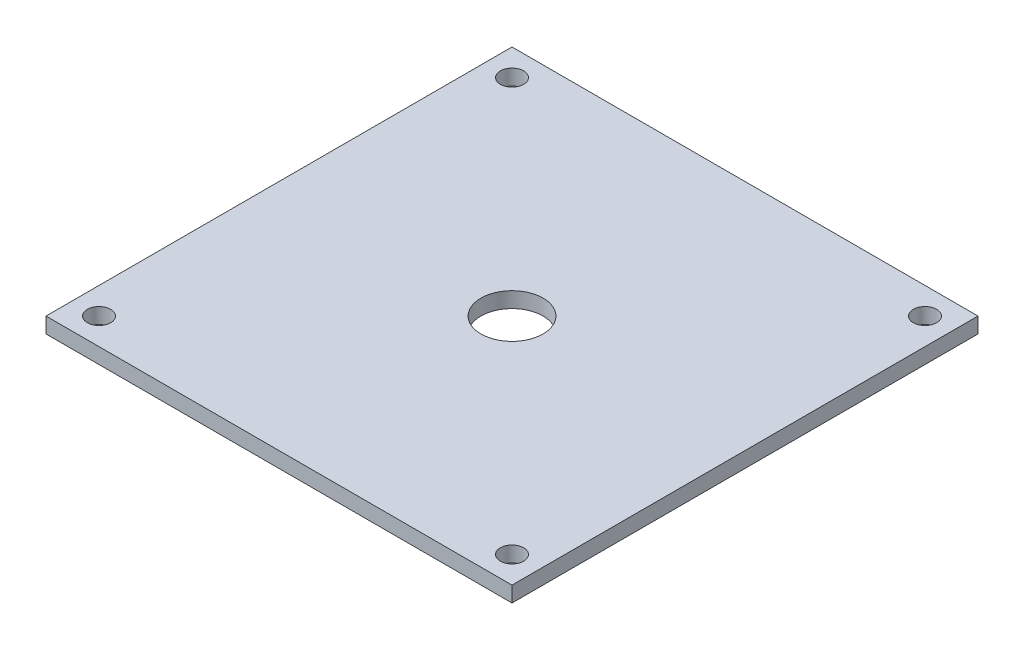
ISO-10303-21;
HEADER;
FILE_DESCRIPTION(('STEP AP214'),'2;1');
FILE_NAME('part.step','',(''),(''),'','','');
FILE_SCHEMA(('AUTOMOTIVE_DESIGN { 1 0 10303 214 1 1 1 1 }'));
ENDSEC;
DATA;
#1=APPLICATION_CONTEXT('core data for automotive mechanical design processes');
#2=APPLICATION_PROTOCOL_DEFINITION('international standard','automotive_design',2000,#1);
#3=PRODUCT_CONTEXT('',#1,'mechanical');
#4=PRODUCT('Part','Part','',(#3));
#5=PRODUCT_RELATED_PRODUCT_CATEGORY('part','',(#4));
#6=PRODUCT_DEFINITION_FORMATION('','',#4);
#7=PRODUCT_DEFINITION_CONTEXT('part definition',#1,'design');
#8=PRODUCT_DEFINITION('design','',#6,#7);
#9=PRODUCT_DEFINITION_SHAPE('','',#8);
#10=(LENGTH_UNIT() NAMED_UNIT(*) SI_UNIT(.MILLI.,.METRE.));
#11=(NAMED_UNIT(*) PLANE_ANGLE_UNIT() SI_UNIT($,.RADIAN.));
#12=(NAMED_UNIT(*) SI_UNIT($,.STERADIAN.) SOLID_ANGLE_UNIT());
#13=UNCERTAINTY_MEASURE_WITH_UNIT(LENGTH_MEASURE(1.E-05),#10,'distance_accuracy_value','');
#14=(GEOMETRIC_REPRESENTATION_CONTEXT(3) GLOBAL_UNCERTAINTY_ASSIGNED_CONTEXT((#13)) GLOBAL_UNIT_ASSIGNED_CONTEXT((#10,
#11,#12)) REPRESENTATION_CONTEXT('',''));
#15=CARTESIAN_POINT('',(0.,0.,0.));
#16=DIRECTION('',(0.,0.,1.));
#17=DIRECTION('',(1.,0.,0.));
#18=AXIS2_PLACEMENT_3D('',#15,#16,#17);
#19=CARTESIAN_POINT('',(0.,10.,0.));
#20=DIRECTION('',(0.,-1.,0.));
#21=DIRECTION('',(0.,0.,-1.));
#22=AXIS2_PLACEMENT_3D('',#19,#20,#21);
#23=PLANE('',#22);
#24=DIRECTION('',(0.,0.,-1.));
#25=VECTOR('',#24,1.);
#26=CARTESIAN_POINT('',(150.,10.,150.));
#27=LINE('',#26,#25);
#28=CARTESIAN_POINT('',(150.,10.,150.));
#29=VERTEX_POINT('',#28);
#30=CARTESIAN_POINT('',(150.,10.,-150.));
#31=VERTEX_POINT('',#30);
#32=EDGE_CURVE('E88',#29,#31,#27,.T.);
#33=ORIENTED_EDGE('',*,*,#32,.T.);
#34=DIRECTION('',(-1.,0.,0.));
#35=VECTOR('',#34,1.);
#36=CARTESIAN_POINT('',(-150.,10.,-150.));
#37=LINE('',#36,#35);
#38=CARTESIAN_POINT('',(-150.,10.,-150.));
#39=VERTEX_POINT('',#38);
#40=EDGE_CURVE('E83',#31,#39,#37,.T.);
#41=ORIENTED_EDGE('',*,*,#40,.T.);
#42=DIRECTION('',(0.,0.,1.));
#43=VECTOR('',#42,1.);
#44=CARTESIAN_POINT('',(-150.,10.,150.));
#45=LINE('',#44,#43);
#46=CARTESIAN_POINT('',(-150.,10.,150.));
#47=VERTEX_POINT('',#46);
#48=EDGE_CURVE('E86',#39,#47,#45,.T.);
#49=ORIENTED_EDGE('',*,*,#48,.T.);
#50=DIRECTION('',(1.,0.,0.));
#51=VECTOR('',#50,1.);
#52=CARTESIAN_POINT('',(-150.,10.,150.));
#53=LINE('',#52,#51);
#54=EDGE_CURVE('E53',#47,#29,#53,.T.);
#55=ORIENTED_EDGE('',*,*,#54,.T.);
#56=EDGE_LOOP('',(#33,#41,#49,#55));
#57=FACE_BOUND('',#56,.T.);
#58=CARTESIAN_POINT('',(0.,10.,0.));
#59=DIRECTION('',(0.,1.,0.));
#60=DIRECTION('',(0.,0.,1.));
#61=AXIS2_PLACEMENT_3D('',#58,#59,#60);
#62=CIRCLE('',#61,20.);
#63=CARTESIAN_POINT('',(0.,10.,20.));
#64=VERTEX_POINT('',#63);
#65=EDGE_CURVE('E103',#64,#64,#62,.T.);
#66=ORIENTED_EDGE('',*,*,#65,.F.);
#67=EDGE_LOOP('',(#66));
#68=FACE_BOUND('',#67,.T.);
#69=CARTESIAN_POINT('',(-132.936074863071,10.,-132.936074863071));
#70=DIRECTION('',(0.,1.,0.));
#71=DIRECTION('',(0.,0.,1.));
#72=AXIS2_PLACEMENT_3D('',#69,#70,#71);
#73=CIRCLE('',#72,7.50000000000001);
#74=CARTESIAN_POINT('',(-132.936074863071,10.,-125.436074863071));
#75=VERTEX_POINT('',#74);
#76=EDGE_CURVE('E118',#75,#75,#73,.T.);
#77=ORIENTED_EDGE('',*,*,#76,.F.);
#78=EDGE_LOOP('',(#77));
#79=FACE_BOUND('',#78,.T.);
#80=CARTESIAN_POINT('',(132.936074863071,10.,-132.936074863094));
#81=DIRECTION('',(0.,1.,0.));
#82=DIRECTION('',(0.,0.,1.));
#83=AXIS2_PLACEMENT_3D('',#80,#81,#82);
#84=CIRCLE('',#83,7.50000000002221);
#85=CARTESIAN_POINT('',(132.936074863071,10.,-125.436074863071));
#86=VERTEX_POINT('',#85);
#87=EDGE_CURVE('E124',#86,#86,#84,.T.);
#88=ORIENTED_EDGE('',*,*,#87,.F.);
#89=EDGE_LOOP('',(#88));
#90=FACE_BOUND('',#89,.T.);
#91=CARTESIAN_POINT('',(132.936074863094,10.,132.936074863048));
#92=DIRECTION('',(0.,1.,0.));
#93=DIRECTION('',(0.,0.,1.));
#94=AXIS2_PLACEMENT_3D('',#91,#92,#93);
#95=CIRCLE('',#94,7.50000000002935);
#96=CARTESIAN_POINT('',(132.936074863094,10.,140.436074863078));
#97=VERTEX_POINT('',#96);
#98=EDGE_CURVE('E130',#97,#97,#95,.T.);
#99=ORIENTED_EDGE('',*,*,#98,.F.);
#100=EDGE_LOOP('',(#99));
#101=FACE_BOUND('',#100,.T.);
#102=CARTESIAN_POINT('',(-132.936074863048,10.,132.936074863071));
#103=DIRECTION('',(0.,1.,0.));
#104=DIRECTION('',(0.,0.,1.));
#105=AXIS2_PLACEMENT_3D('',#102,#103,#104);
#106=CIRCLE('',#105,7.50000000000839);
#107=CARTESIAN_POINT('',(-132.936074863048,10.,140.436074863079));
#108=VERTEX_POINT('',#107);
#109=EDGE_CURVE('E136',#108,#108,#106,.T.);
#110=ORIENTED_EDGE('',*,*,#109,.F.);
#111=EDGE_LOOP('',(#110));
#112=FACE_BOUND('',#111,.T.);
#113=ADVANCED_FACE('F36',(#57,#68,#79,#90,#101,#112),#23,.F.);
#114=CARTESIAN_POINT('',(0.,0.,0.));
#115=DIRECTION('',(0.,-1.,0.));
#116=DIRECTION('',(0.,0.,-1.));
#117=AXIS2_PLACEMENT_3D('',#114,#115,#116);
#118=PLANE('',#117);
#119=CARTESIAN_POINT('',(132.936074863094,0.,132.936074863048));
#120=DIRECTION('',(0.,1.,0.));
#121=DIRECTION('',(0.,0.,1.));
#122=AXIS2_PLACEMENT_3D('',#119,#120,#121);
#123=CIRCLE('',#122,7.50000000002935);
#124=CARTESIAN_POINT('',(132.936074863094,0.,140.436074863078));
#125=VERTEX_POINT('',#124);
#126=EDGE_CURVE('E133',#125,#125,#123,.T.);
#127=ORIENTED_EDGE('',*,*,#126,.T.);
#128=EDGE_LOOP('',(#127));
#129=FACE_BOUND('',#128,.T.);
#130=CARTESIAN_POINT('',(-132.936074863071,0.,-132.936074863071));
#131=DIRECTION('',(0.,1.,0.));
#132=DIRECTION('',(0.,0.,1.));
#133=AXIS2_PLACEMENT_3D('',#130,#131,#132);
#134=CIRCLE('',#133,7.50000000000001);
#135=CARTESIAN_POINT('',(-132.936074863071,0.,-125.436074863071));
#136=VERTEX_POINT('',#135);
#137=EDGE_CURVE('E121',#136,#136,#134,.T.);
#138=ORIENTED_EDGE('',*,*,#137,.T.);
#139=EDGE_LOOP('',(#138));
#140=FACE_BOUND('',#139,.T.);
#141=DIRECTION('',(0.,0.,-1.));
#142=VECTOR('',#141,1.);
#143=CARTESIAN_POINT('',(150.,0.,150.));
#144=LINE('',#143,#142);
#145=CARTESIAN_POINT('',(150.,0.,150.));
#146=VERTEX_POINT('',#145);
#147=CARTESIAN_POINT('',(150.,0.,-150.));
#148=VERTEX_POINT('',#147);
#149=EDGE_CURVE('E100',#146,#148,#144,.T.);
#150=ORIENTED_EDGE('',*,*,#149,.F.);
#151=DIRECTION('',(1.,0.,0.));
#152=VECTOR('',#151,1.);
#153=CARTESIAN_POINT('',(-150.,0.,150.));
#154=LINE('',#153,#152);
#155=CARTESIAN_POINT('',(-150.,0.,150.));
#156=VERTEX_POINT('',#155);
#157=EDGE_CURVE('E76',#156,#146,#154,.T.);
#158=ORIENTED_EDGE('',*,*,#157,.F.);
#159=DIRECTION('',(0.,0.,1.));
#160=VECTOR('',#159,1.);
#161=CARTESIAN_POINT('',(-150.,0.,150.));
#162=LINE('',#161,#160);
#163=CARTESIAN_POINT('',(-150.,0.,-150.));
#164=VERTEX_POINT('',#163);
#165=EDGE_CURVE('E70',#164,#156,#162,.T.);
#166=ORIENTED_EDGE('',*,*,#165,.F.);
#167=DIRECTION('',(-1.,0.,0.));
#168=VECTOR('',#167,1.);
#169=CARTESIAN_POINT('',(-150.,0.,-150.));
#170=LINE('',#169,#168);
#171=EDGE_CURVE('E92',#148,#164,#170,.T.);
#172=ORIENTED_EDGE('',*,*,#171,.F.);
#173=EDGE_LOOP('',(#150,#158,#166,#172));
#174=FACE_BOUND('',#173,.T.);
#175=CARTESIAN_POINT('',(0.,0.,0.));
#176=DIRECTION('',(0.,1.,0.));
#177=DIRECTION('',(0.,0.,1.));
#178=AXIS2_PLACEMENT_3D('',#175,#176,#177);
#179=CIRCLE('',#178,20.);
#180=CARTESIAN_POINT('',(0.,0.,20.));
#181=VERTEX_POINT('',#180);
#182=EDGE_CURVE('E115',#181,#181,#179,.T.);
#183=ORIENTED_EDGE('',*,*,#182,.T.);
#184=EDGE_LOOP('',(#183));
#185=FACE_BOUND('',#184,.T.);
#186=CARTESIAN_POINT('',(132.936074863071,0.,-132.936074863094));
#187=DIRECTION('',(0.,1.,0.));
#188=DIRECTION('',(0.,0.,1.));
#189=AXIS2_PLACEMENT_3D('',#186,#187,#188);
#190=CIRCLE('',#189,7.50000000002221);
#191=CARTESIAN_POINT('',(132.936074863071,0.,-125.436074863071));
#192=VERTEX_POINT('',#191);
#193=EDGE_CURVE('E127',#192,#192,#190,.T.);
#194=ORIENTED_EDGE('',*,*,#193,.T.);
#195=EDGE_LOOP('',(#194));
#196=FACE_BOUND('',#195,.T.);
#197=CARTESIAN_POINT('',(-132.936074863048,0.,132.936074863071));
#198=DIRECTION('',(0.,1.,0.));
#199=DIRECTION('',(0.,0.,1.));
#200=AXIS2_PLACEMENT_3D('',#197,#198,#199);
#201=CIRCLE('',#200,7.50000000000839);
#202=CARTESIAN_POINT('',(-132.936074863048,0.,140.436074863079));
#203=VERTEX_POINT('',#202);
#204=EDGE_CURVE('E139',#203,#203,#201,.T.);
#205=ORIENTED_EDGE('',*,*,#204,.T.);
#206=EDGE_LOOP('',(#205));
#207=FACE_BOUND('',#206,.T.);
#208=ADVANCED_FACE('F111',(#129,#140,#174,#185,#196,#207),#118,.T.);
#209=CARTESIAN_POINT('',(150.,10.,150.));
#210=DIRECTION('',(-1.,0.,0.));
#211=DIRECTION('',(0.,0.,1.));
#212=AXIS2_PLACEMENT_3D('',#209,#210,#211);
#213=PLANE('',#212);
#214=ORIENTED_EDGE('',*,*,#149,.T.);
#215=DIRECTION('',(0.,-1.,0.));
#216=VECTOR('',#215,1.);
#217=CARTESIAN_POINT('',(150.,10.,-150.));
#218=LINE('',#217,#216);
#219=EDGE_CURVE('E11',#31,#148,#218,.T.);
#220=ORIENTED_EDGE('',*,*,#219,.F.);
#221=ORIENTED_EDGE('',*,*,#32,.F.);
#222=DIRECTION('',(0.,-1.,0.));
#223=VECTOR('',#222,1.);
#224=CARTESIAN_POINT('',(150.,10.,150.));
#225=LINE('',#224,#223);
#226=EDGE_CURVE('E96',#29,#146,#225,.T.);
#227=ORIENTED_EDGE('',*,*,#226,.T.);
#228=EDGE_LOOP('',(#214,#220,#221,#227));
#229=FACE_BOUND('',#228,.T.);
#230=ADVANCED_FACE('F38',(#229),#213,.F.);
#231=CARTESIAN_POINT('',(-150.,10.,-150.));
#232=DIRECTION('',(0.,0.,1.));
#233=DIRECTION('',(1.,0.,0.));
#234=AXIS2_PLACEMENT_3D('',#231,#232,#233);
#235=PLANE('',#234);
#236=ORIENTED_EDGE('',*,*,#171,.T.);
#237=DIRECTION('',(0.,-1.,0.));
#238=VECTOR('',#237,1.);
#239=CARTESIAN_POINT('',(-150.,10.,-150.));
#240=LINE('',#239,#238);
#241=EDGE_CURVE('E45',#39,#164,#240,.T.);
#242=ORIENTED_EDGE('',*,*,#241,.F.);
#243=ORIENTED_EDGE('',*,*,#40,.F.);
#244=ORIENTED_EDGE('',*,*,#219,.T.);
#245=EDGE_LOOP('',(#236,#242,#243,#244));
#246=FACE_BOUND('',#245,.T.);
#247=ADVANCED_FACE('F91',(#246),#235,.F.);
#248=CARTESIAN_POINT('',(-150.,10.,150.));
#249=DIRECTION('',(1.,0.,0.));
#250=DIRECTION('',(0.,0.,-1.));
#251=AXIS2_PLACEMENT_3D('',#248,#249,#250);
#252=PLANE('',#251);
#253=ORIENTED_EDGE('',*,*,#165,.T.);
#254=DIRECTION('',(0.,-1.,0.));
#255=VECTOR('',#254,1.);
#256=CARTESIAN_POINT('',(-150.,10.,150.));
#257=LINE('',#256,#255);
#258=EDGE_CURVE('E93',#47,#156,#257,.T.);
#259=ORIENTED_EDGE('',*,*,#258,.F.);
#260=ORIENTED_EDGE('',*,*,#48,.F.);
#261=ORIENTED_EDGE('',*,*,#241,.T.);
#262=EDGE_LOOP('',(#253,#259,#260,#261));
#263=FACE_BOUND('',#262,.T.);
#264=ADVANCED_FACE('F94',(#263),#252,.F.);
#265=CARTESIAN_POINT('',(-150.,10.,150.));
#266=DIRECTION('',(0.,0.,-1.));
#267=DIRECTION('',(-1.,0.,0.));
#268=AXIS2_PLACEMENT_3D('',#265,#266,#267);
#269=PLANE('',#268);
#270=ORIENTED_EDGE('',*,*,#157,.T.);
#271=ORIENTED_EDGE('',*,*,#226,.F.);
#272=ORIENTED_EDGE('',*,*,#54,.F.);
#273=ORIENTED_EDGE('',*,*,#258,.T.);
#274=EDGE_LOOP('',(#270,#271,#272,#273));
#275=FACE_BOUND('',#274,.T.);
#276=ADVANCED_FACE('F108',(#275),#269,.F.);
#277=CARTESIAN_POINT('',(0.,10.,0.));
#278=DIRECTION('',(0.,-1.,0.));
#279=DIRECTION('',(0.,0.,-1.));
#280=AXIS2_PLACEMENT_3D('',#277,#278,#279);
#281=CYLINDRICAL_SURFACE('',#280,20.);
#282=ORIENTED_EDGE('',*,*,#65,.T.);
#283=EDGE_LOOP('',(#282));
#284=FACE_BOUND('',#283,.T.);
#285=ORIENTED_EDGE('',*,*,#182,.F.);
#286=EDGE_LOOP('',(#285));
#287=FACE_BOUND('',#286,.T.);
#288=ADVANCED_FACE('F156',(#284,#287),#281,.F.);
#289=CARTESIAN_POINT('',(-132.936074863071,10.,-132.936074863071));
#290=DIRECTION('',(0.,-1.,0.));
#291=DIRECTION('',(0.,0.,-1.));
#292=AXIS2_PLACEMENT_3D('',#289,#290,#291);
#293=CYLINDRICAL_SURFACE('',#292,7.50000000000001);
#294=ORIENTED_EDGE('',*,*,#76,.T.);
#295=EDGE_LOOP('',(#294));
#296=FACE_BOUND('',#295,.T.);
#297=ORIENTED_EDGE('',*,*,#137,.F.);
#298=EDGE_LOOP('',(#297));
#299=FACE_BOUND('',#298,.T.);
#300=ADVANCED_FACE('F202',(#296,#299),#293,.F.);
#301=CARTESIAN_POINT('',(132.936074863071,10.,-132.936074863094));
#302=DIRECTION('',(0.,-1.,0.));
#303=DIRECTION('',(0.,0.,-1.));
#304=AXIS2_PLACEMENT_3D('',#301,#302,#303);
#305=CYLINDRICAL_SURFACE('',#304,7.50000000002221);
#306=ORIENTED_EDGE('',*,*,#87,.T.);
#307=EDGE_LOOP('',(#306));
#308=FACE_BOUND('',#307,.T.);
#309=ORIENTED_EDGE('',*,*,#193,.F.);
#310=EDGE_LOOP('',(#309));
#311=FACE_BOUND('',#310,.T.);
#312=ADVANCED_FACE('F210',(#308,#311),#305,.F.);
#313=CARTESIAN_POINT('',(132.936074863094,10.,132.936074863048));
#314=DIRECTION('',(0.,-1.,0.));
#315=DIRECTION('',(0.,0.,-1.));
#316=AXIS2_PLACEMENT_3D('',#313,#314,#315);
#317=CYLINDRICAL_SURFACE('',#316,7.50000000002935);
#318=ORIENTED_EDGE('',*,*,#98,.T.);
#319=EDGE_LOOP('',(#318));
#320=FACE_BOUND('',#319,.T.);
#321=ORIENTED_EDGE('',*,*,#126,.F.);
#322=EDGE_LOOP('',(#321));
#323=FACE_BOUND('',#322,.T.);
#324=ADVANCED_FACE('F218',(#320,#323),#317,.F.);
#325=CARTESIAN_POINT('',(-132.936074863048,10.,132.936074863071));
#326=DIRECTION('',(0.,-1.,0.));
#327=DIRECTION('',(0.,0.,-1.));
#328=AXIS2_PLACEMENT_3D('',#325,#326,#327);
#329=CYLINDRICAL_SURFACE('',#328,7.50000000000839);
#330=ORIENTED_EDGE('',*,*,#109,.T.);
#331=EDGE_LOOP('',(#330));
#332=FACE_BOUND('',#331,.T.);
#333=ORIENTED_EDGE('',*,*,#204,.F.);
#334=EDGE_LOOP('',(#333));
#335=FACE_BOUND('',#334,.T.);
#336=ADVANCED_FACE('F145',(#332,#335),#329,.F.);
#337=CLOSED_SHELL('',(#113,#208,#230,#247,#264,#276,#288,#300,#312,#324,#336));
#338=MANIFOLD_SOLID_BREP('B2',#337);
#339=ADVANCED_BREP_SHAPE_REPRESENTATION('',(#18,#338),#14);
#340=SHAPE_DEFINITION_REPRESENTATION(#9,#339);
ENDSEC;
END-ISO-10303-21;
